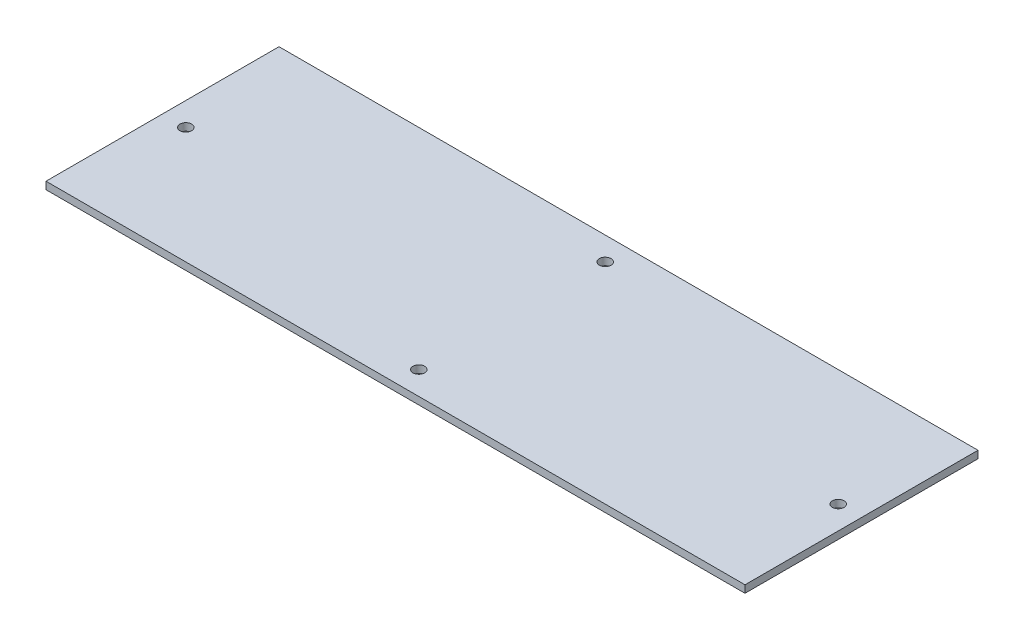
ISO-10303-21;
HEADER;
FILE_DESCRIPTION(('STEP AP214'),'2;1');
FILE_NAME('part.step','',(''),(''),'','','');
FILE_SCHEMA(('AUTOMOTIVE_DESIGN { 1 0 10303 214 1 1 1 1 }'));
ENDSEC;
DATA;
#1=APPLICATION_CONTEXT('core data for automotive mechanical design processes');
#2=APPLICATION_PROTOCOL_DEFINITION('international standard','automotive_design',2000,#1);
#3=PRODUCT_CONTEXT('',#1,'mechanical');
#4=PRODUCT('Part','Part','',(#3));
#5=PRODUCT_RELATED_PRODUCT_CATEGORY('part','',(#4));
#6=PRODUCT_DEFINITION_FORMATION('','',#4);
#7=PRODUCT_DEFINITION_CONTEXT('part definition',#1,'design');
#8=PRODUCT_DEFINITION('design','',#6,#7);
#9=PRODUCT_DEFINITION_SHAPE('','',#8);
#10=(LENGTH_UNIT() NAMED_UNIT(*) SI_UNIT(.MILLI.,.METRE.));
#11=(NAMED_UNIT(*) PLANE_ANGLE_UNIT() SI_UNIT($,.RADIAN.));
#12=(NAMED_UNIT(*) SI_UNIT($,.STERADIAN.) SOLID_ANGLE_UNIT());
#13=UNCERTAINTY_MEASURE_WITH_UNIT(LENGTH_MEASURE(1.E-05),#10,'distance_accuracy_value','');
#14=(GEOMETRIC_REPRESENTATION_CONTEXT(3) GLOBAL_UNCERTAINTY_ASSIGNED_CONTEXT((#13)) GLOBAL_UNIT_ASSIGNED_CONTEXT((#10,
#11,#12)) REPRESENTATION_CONTEXT('',''));
#15=CARTESIAN_POINT('',(0.,0.,0.));
#16=DIRECTION('',(0.,0.,1.));
#17=DIRECTION('',(1.,0.,0.));
#18=AXIS2_PLACEMENT_3D('',#15,#16,#17);
#19=CARTESIAN_POINT('',(0.,3.175,0.));
#20=DIRECTION('',(0.,-1.,0.));
#21=DIRECTION('',(0.,0.,-1.));
#22=AXIS2_PLACEMENT_3D('',#19,#20,#21);
#23=PLANE('',#22);
#24=DIRECTION('',(0.,0.,1.));
#25=VECTOR('',#24,1.);
#26=CARTESIAN_POINT('',(0.,3.175,0.));
#27=LINE('',#26,#25);
#28=CARTESIAN_POINT('',(0.,3.175,-100.));
#29=VERTEX_POINT('',#28);
#30=CARTESIAN_POINT('',(0.,3.175,0.));
#31=VERTEX_POINT('',#30);
#32=EDGE_CURVE('E85',#29,#31,#27,.T.);
#33=ORIENTED_EDGE('',*,*,#32,.T.);
#34=DIRECTION('',(1.,0.,0.));
#35=VECTOR('',#34,1.);
#36=CARTESIAN_POINT('',(0.,3.175,0.));
#37=LINE('',#36,#35);
#38=CARTESIAN_POINT('',(300.,3.175,0.));
#39=VERTEX_POINT('',#38);
#40=EDGE_CURVE('E80',#31,#39,#37,.T.);
#41=ORIENTED_EDGE('',*,*,#40,.T.);
#42=DIRECTION('',(0.,0.,-1.));
#43=VECTOR('',#42,1.);
#44=CARTESIAN_POINT('',(300.,3.175,0.));
#45=LINE('',#44,#43);
#46=CARTESIAN_POINT('',(300.,3.175,-100.));
#47=VERTEX_POINT('',#46);
#48=EDGE_CURVE('E83',#39,#47,#45,.T.);
#49=ORIENTED_EDGE('',*,*,#48,.T.);
#50=DIRECTION('',(-1.,0.,0.));
#51=VECTOR('',#50,1.);
#52=CARTESIAN_POINT('',(0.,3.175,-100.));
#53=LINE('',#52,#51);
#54=EDGE_CURVE('E50',#47,#29,#53,.T.);
#55=ORIENTED_EDGE('',*,*,#54,.T.);
#56=EDGE_LOOP('',(#33,#41,#49,#55));
#57=FACE_BOUND('',#56,.T.);
#58=CARTESIAN_POINT('',(150.,3.175,-10.));
#59=DIRECTION('',(0.,1.,0.));
#60=DIRECTION('',(0.,0.,1.));
#61=AXIS2_PLACEMENT_3D('',#58,#59,#60);
#62=CIRCLE('',#61,2.5);
#63=CARTESIAN_POINT('',(150.,3.175,-7.50000000000001));
#64=VERTEX_POINT('',#63);
#65=EDGE_CURVE('E100',#64,#64,#62,.T.);
#66=ORIENTED_EDGE('',*,*,#65,.F.);
#67=EDGE_LOOP('',(#66));
#68=FACE_BOUND('',#67,.T.);
#69=CARTESIAN_POINT('',(10.,3.175,-50.));
#70=DIRECTION('',(0.,1.,0.));
#71=DIRECTION('',(0.,0.,1.));
#72=AXIS2_PLACEMENT_3D('',#69,#70,#71);
#73=CIRCLE('',#72,2.5);
#74=CARTESIAN_POINT('',(10.,3.175,-47.5));
#75=VERTEX_POINT('',#74);
#76=EDGE_CURVE('E115',#75,#75,#73,.T.);
#77=ORIENTED_EDGE('',*,*,#76,.F.);
#78=EDGE_LOOP('',(#77));
#79=FACE_BOUND('',#78,.T.);
#80=CARTESIAN_POINT('',(150.,3.175,-90.));
#81=DIRECTION('',(0.,1.,0.));
#82=DIRECTION('',(0.,0.,1.));
#83=AXIS2_PLACEMENT_3D('',#80,#81,#82);
#84=CIRCLE('',#83,2.5);
#85=CARTESIAN_POINT('',(150.,3.175,-87.5));
#86=VERTEX_POINT('',#85);
#87=EDGE_CURVE('E121',#86,#86,#84,.T.);
#88=ORIENTED_EDGE('',*,*,#87,.F.);
#89=EDGE_LOOP('',(#88));
#90=FACE_BOUND('',#89,.T.);
#91=CARTESIAN_POINT('',(290.,3.175,-50.));
#92=DIRECTION('',(0.,1.,0.));
#93=DIRECTION('',(0.,0.,1.));
#94=AXIS2_PLACEMENT_3D('',#91,#92,#93);
#95=CIRCLE('',#94,2.50000000000002);
#96=CARTESIAN_POINT('',(290.,3.175,-47.5));
#97=VERTEX_POINT('',#96);
#98=EDGE_CURVE('E127',#97,#97,#95,.T.);
#99=ORIENTED_EDGE('',*,*,#98,.F.);
#100=EDGE_LOOP('',(#99));
#101=FACE_BOUND('',#100,.T.);
#102=ADVANCED_FACE('F33',(#57,#68,#79,#90,#101),#23,.F.);
#103=CARTESIAN_POINT('',(0.,0.,0.));
#104=DIRECTION('',(0.,-1.,0.));
#105=DIRECTION('',(0.,0.,-1.));
#106=AXIS2_PLACEMENT_3D('',#103,#104,#105);
#107=PLANE('',#106);
#108=CARTESIAN_POINT('',(150.,0.,-90.));
#109=DIRECTION('',(0.,1.,0.));
#110=DIRECTION('',(0.,0.,1.));
#111=AXIS2_PLACEMENT_3D('',#108,#109,#110);
#112=CIRCLE('',#111,2.5);
#113=CARTESIAN_POINT('',(150.,0.,-87.5));
#114=VERTEX_POINT('',#113);
#115=EDGE_CURVE('E124',#114,#114,#112,.T.);
#116=ORIENTED_EDGE('',*,*,#115,.T.);
#117=EDGE_LOOP('',(#116));
#118=FACE_BOUND('',#117,.T.);
#119=CARTESIAN_POINT('',(150.,0.,-10.));
#120=DIRECTION('',(0.,1.,0.));
#121=DIRECTION('',(0.,0.,1.));
#122=AXIS2_PLACEMENT_3D('',#119,#120,#121);
#123=CIRCLE('',#122,2.5);
#124=CARTESIAN_POINT('',(150.,0.,-7.50000000000001));
#125=VERTEX_POINT('',#124);
#126=EDGE_CURVE('E112',#125,#125,#123,.T.);
#127=ORIENTED_EDGE('',*,*,#126,.T.);
#128=EDGE_LOOP('',(#127));
#129=FACE_BOUND('',#128,.T.);
#130=DIRECTION('',(0.,0.,1.));
#131=VECTOR('',#130,1.);
#132=CARTESIAN_POINT('',(0.,0.,0.));
#133=LINE('',#132,#131);
#134=CARTESIAN_POINT('',(0.,0.,-100.));
#135=VERTEX_POINT('',#134);
#136=CARTESIAN_POINT('',(0.,0.,0.));
#137=VERTEX_POINT('',#136);
#138=EDGE_CURVE('E97',#135,#137,#133,.T.);
#139=ORIENTED_EDGE('',*,*,#138,.F.);
#140=DIRECTION('',(-1.,0.,0.));
#141=VECTOR('',#140,1.);
#142=CARTESIAN_POINT('',(0.,0.,-100.));
#143=LINE('',#142,#141);
#144=CARTESIAN_POINT('',(300.,0.,-100.));
#145=VERTEX_POINT('',#144);
#146=EDGE_CURVE('E73',#145,#135,#143,.T.);
#147=ORIENTED_EDGE('',*,*,#146,.F.);
#148=DIRECTION('',(0.,0.,-1.));
#149=VECTOR('',#148,1.);
#150=CARTESIAN_POINT('',(300.,0.,0.));
#151=LINE('',#150,#149);
#152=CARTESIAN_POINT('',(300.,0.,0.));
#153=VERTEX_POINT('',#152);
#154=EDGE_CURVE('E67',#153,#145,#151,.T.);
#155=ORIENTED_EDGE('',*,*,#154,.F.);
#156=DIRECTION('',(1.,0.,0.));
#157=VECTOR('',#156,1.);
#158=CARTESIAN_POINT('',(0.,0.,0.));
#159=LINE('',#158,#157);
#160=EDGE_CURVE('E89',#137,#153,#159,.T.);
#161=ORIENTED_EDGE('',*,*,#160,.F.);
#162=EDGE_LOOP('',(#139,#147,#155,#161));
#163=FACE_BOUND('',#162,.T.);
#164=CARTESIAN_POINT('',(10.,0.,-50.));
#165=DIRECTION('',(0.,1.,0.));
#166=DIRECTION('',(0.,0.,1.));
#167=AXIS2_PLACEMENT_3D('',#164,#165,#166);
#168=CIRCLE('',#167,2.5);
#169=CARTESIAN_POINT('',(10.,0.,-47.5));
#170=VERTEX_POINT('',#169);
#171=EDGE_CURVE('E118',#170,#170,#168,.T.);
#172=ORIENTED_EDGE('',*,*,#171,.T.);
#173=EDGE_LOOP('',(#172));
#174=FACE_BOUND('',#173,.T.);
#175=CARTESIAN_POINT('',(290.,0.,-50.));
#176=DIRECTION('',(0.,1.,0.));
#177=DIRECTION('',(0.,0.,1.));
#178=AXIS2_PLACEMENT_3D('',#175,#176,#177);
#179=CIRCLE('',#178,2.50000000000002);
#180=CARTESIAN_POINT('',(290.,0.,-47.5));
#181=VERTEX_POINT('',#180);
#182=EDGE_CURVE('E130',#181,#181,#179,.T.);
#183=ORIENTED_EDGE('',*,*,#182,.T.);
#184=EDGE_LOOP('',(#183));
#185=FACE_BOUND('',#184,.T.);
#186=ADVANCED_FACE('F108',(#118,#129,#163,#174,#185),#107,.T.);
#187=CARTESIAN_POINT('',(0.,3.175,0.));
#188=DIRECTION('',(1.,0.,0.));
#189=DIRECTION('',(0.,0.,-1.));
#190=AXIS2_PLACEMENT_3D('',#187,#188,#189);
#191=PLANE('',#190);
#192=ORIENTED_EDGE('',*,*,#138,.T.);
#193=DIRECTION('',(0.,-1.,0.));
#194=VECTOR('',#193,1.);
#195=CARTESIAN_POINT('',(0.,3.175,0.));
#196=LINE('',#195,#194);
#197=EDGE_CURVE('E11',#31,#137,#196,.T.);
#198=ORIENTED_EDGE('',*,*,#197,.F.);
#199=ORIENTED_EDGE('',*,*,#32,.F.);
#200=DIRECTION('',(0.,-1.,0.));
#201=VECTOR('',#200,1.);
#202=CARTESIAN_POINT('',(0.,3.175,-100.));
#203=LINE('',#202,#201);
#204=EDGE_CURVE('E93',#29,#135,#203,.T.);
#205=ORIENTED_EDGE('',*,*,#204,.T.);
#206=EDGE_LOOP('',(#192,#198,#199,#205));
#207=FACE_BOUND('',#206,.T.);
#208=ADVANCED_FACE('F35',(#207),#191,.F.);
#209=CARTESIAN_POINT('',(0.,3.175,0.));
#210=DIRECTION('',(0.,0.,-1.));
#211=DIRECTION('',(-1.,0.,0.));
#212=AXIS2_PLACEMENT_3D('',#209,#210,#211);
#213=PLANE('',#212);
#214=ORIENTED_EDGE('',*,*,#160,.T.);
#215=DIRECTION('',(0.,-1.,0.));
#216=VECTOR('',#215,1.);
#217=CARTESIAN_POINT('',(300.,3.175,0.));
#218=LINE('',#217,#216);
#219=EDGE_CURVE('E42',#39,#153,#218,.T.);
#220=ORIENTED_EDGE('',*,*,#219,.F.);
#221=ORIENTED_EDGE('',*,*,#40,.F.);
#222=ORIENTED_EDGE('',*,*,#197,.T.);
#223=EDGE_LOOP('',(#214,#220,#221,#222));
#224=FACE_BOUND('',#223,.T.);
#225=ADVANCED_FACE('F88',(#224),#213,.F.);
#226=CARTESIAN_POINT('',(300.,3.175,0.));
#227=DIRECTION('',(-1.,0.,0.));
#228=DIRECTION('',(0.,0.,1.));
#229=AXIS2_PLACEMENT_3D('',#226,#227,#228);
#230=PLANE('',#229);
#231=ORIENTED_EDGE('',*,*,#154,.T.);
#232=DIRECTION('',(0.,-1.,0.));
#233=VECTOR('',#232,1.);
#234=CARTESIAN_POINT('',(300.,3.175,-100.));
#235=LINE('',#234,#233);
#236=EDGE_CURVE('E90',#47,#145,#235,.T.);
#237=ORIENTED_EDGE('',*,*,#236,.F.);
#238=ORIENTED_EDGE('',*,*,#48,.F.);
#239=ORIENTED_EDGE('',*,*,#219,.T.);
#240=EDGE_LOOP('',(#231,#237,#238,#239));
#241=FACE_BOUND('',#240,.T.);
#242=ADVANCED_FACE('F91',(#241),#230,.F.);
#243=CARTESIAN_POINT('',(0.,3.175,-100.));
#244=DIRECTION('',(0.,0.,1.));
#245=DIRECTION('',(1.,0.,0.));
#246=AXIS2_PLACEMENT_3D('',#243,#244,#245);
#247=PLANE('',#246);
#248=ORIENTED_EDGE('',*,*,#146,.T.);
#249=ORIENTED_EDGE('',*,*,#204,.F.);
#250=ORIENTED_EDGE('',*,*,#54,.F.);
#251=ORIENTED_EDGE('',*,*,#236,.T.);
#252=EDGE_LOOP('',(#248,#249,#250,#251));
#253=FACE_BOUND('',#252,.T.);
#254=ADVANCED_FACE('F105',(#253),#247,.F.);
#255=CARTESIAN_POINT('',(150.,3.175,-10.));
#256=DIRECTION('',(0.,-1.,0.));
#257=DIRECTION('',(0.,0.,-1.));
#258=AXIS2_PLACEMENT_3D('',#255,#256,#257);
#259=CYLINDRICAL_SURFACE('',#258,2.5);
#260=ORIENTED_EDGE('',*,*,#65,.T.);
#261=EDGE_LOOP('',(#260));
#262=FACE_BOUND('',#261,.T.);
#263=ORIENTED_EDGE('',*,*,#126,.F.);
#264=EDGE_LOOP('',(#263));
#265=FACE_BOUND('',#264,.T.);
#266=ADVANCED_FACE('F147',(#262,#265),#259,.F.);
#267=CARTESIAN_POINT('',(10.,3.175,-50.));
#268=DIRECTION('',(0.,-1.,0.));
#269=DIRECTION('',(0.,0.,-1.));
#270=AXIS2_PLACEMENT_3D('',#267,#268,#269);
#271=CYLINDRICAL_SURFACE('',#270,2.5);
#272=ORIENTED_EDGE('',*,*,#76,.T.);
#273=EDGE_LOOP('',(#272));
#274=FACE_BOUND('',#273,.T.);
#275=ORIENTED_EDGE('',*,*,#171,.F.);
#276=EDGE_LOOP('',(#275));
#277=FACE_BOUND('',#276,.T.);
#278=ADVANCED_FACE('F193',(#274,#277),#271,.F.);
#279=CARTESIAN_POINT('',(150.,3.175,-90.));
#280=DIRECTION('',(0.,-1.,0.));
#281=DIRECTION('',(0.,0.,-1.));
#282=AXIS2_PLACEMENT_3D('',#279,#280,#281);
#283=CYLINDRICAL_SURFACE('',#282,2.5);
#284=ORIENTED_EDGE('',*,*,#87,.T.);
#285=EDGE_LOOP('',(#284));
#286=FACE_BOUND('',#285,.T.);
#287=ORIENTED_EDGE('',*,*,#115,.F.);
#288=EDGE_LOOP('',(#287));
#289=FACE_BOUND('',#288,.T.);
#290=ADVANCED_FACE('F201',(#286,#289),#283,.F.);
#291=CARTESIAN_POINT('',(290.,3.175,-50.));
#292=DIRECTION('',(0.,-1.,0.));
#293=DIRECTION('',(0.,0.,-1.));
#294=AXIS2_PLACEMENT_3D('',#291,#292,#293);
#295=CYLINDRICAL_SURFACE('',#294,2.50000000000002);
#296=ORIENTED_EDGE('',*,*,#98,.T.);
#297=EDGE_LOOP('',(#296));
#298=FACE_BOUND('',#297,.T.);
#299=ORIENTED_EDGE('',*,*,#182,.F.);
#300=EDGE_LOOP('',(#299));
#301=FACE_BOUND('',#300,.T.);
#302=ADVANCED_FACE('F136',(#298,#301),#295,.F.);
#303=CLOSED_SHELL('',(#102,#186,#208,#225,#242,#254,#266,#278,#290,#302));
#304=MANIFOLD_SOLID_BREP('B2',#303);
#305=ADVANCED_BREP_SHAPE_REPRESENTATION('',(#18,#304),#14);
#306=SHAPE_DEFINITION_REPRESENTATION(#9,#305);
ENDSEC;
END-ISO-10303-21;
